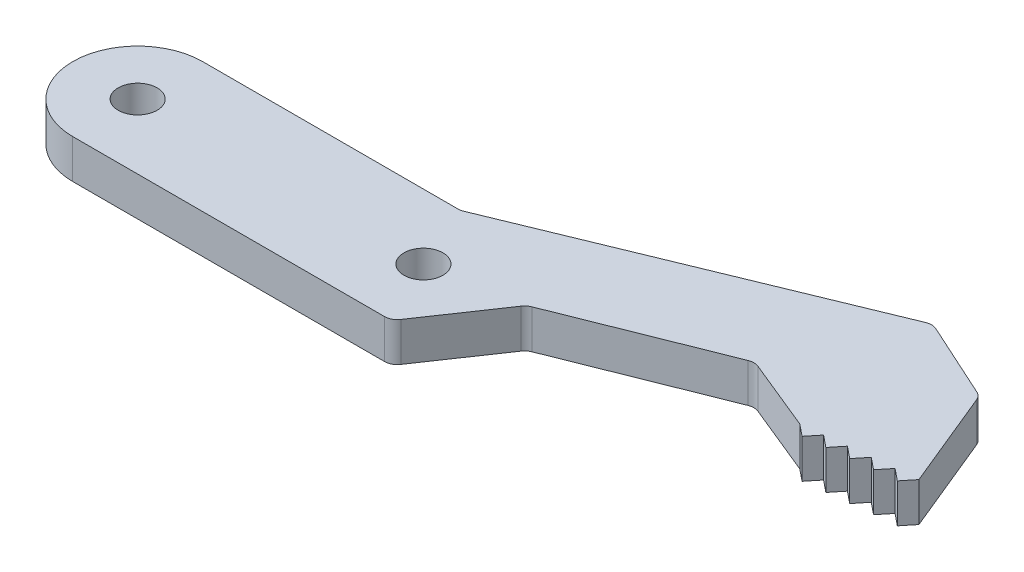
ISO-10303-21;
HEADER;
FILE_DESCRIPTION(('STEP AP214'),'2;1');
FILE_NAME('part.step','',(''),(''),'','','');
FILE_SCHEMA(('AUTOMOTIVE_DESIGN { 1 0 10303 214 1 1 1 1 }'));
ENDSEC;
DATA;
#1=APPLICATION_CONTEXT('core data for automotive mechanical design processes');
#2=APPLICATION_PROTOCOL_DEFINITION('international standard','automotive_design',2000,#1);
#3=PRODUCT_CONTEXT('',#1,'mechanical');
#4=PRODUCT('Part','Part','',(#3));
#5=PRODUCT_RELATED_PRODUCT_CATEGORY('part','',(#4));
#6=PRODUCT_DEFINITION_FORMATION('','',#4);
#7=PRODUCT_DEFINITION_CONTEXT('part definition',#1,'design');
#8=PRODUCT_DEFINITION('design','',#6,#7);
#9=PRODUCT_DEFINITION_SHAPE('','',#8);
#10=(LENGTH_UNIT() NAMED_UNIT(*) SI_UNIT(.MILLI.,.METRE.));
#11=(NAMED_UNIT(*) PLANE_ANGLE_UNIT() SI_UNIT($,.RADIAN.));
#12=(NAMED_UNIT(*) SI_UNIT($,.STERADIAN.) SOLID_ANGLE_UNIT());
#13=UNCERTAINTY_MEASURE_WITH_UNIT(LENGTH_MEASURE(1.E-05),#10,'distance_accuracy_value','');
#14=(GEOMETRIC_REPRESENTATION_CONTEXT(3) GLOBAL_UNCERTAINTY_ASSIGNED_CONTEXT((#13)) GLOBAL_UNIT_ASSIGNED_CONTEXT((#10,
#11,#12)) REPRESENTATION_CONTEXT('',''));
#15=CARTESIAN_POINT('',(0.,0.,0.));
#16=DIRECTION('',(0.,0.,1.));
#17=DIRECTION('',(1.,0.,0.));
#18=AXIS2_PLACEMENT_3D('',#15,#16,#17);
#19=CARTESIAN_POINT('',(29.3927079970185,3.,-0.393076672311641));
#20=DIRECTION('',(0.,-1.,0.));
#21=DIRECTION('',(0.,0.,-1.));
#22=AXIS2_PLACEMENT_3D('',#19,#20,#21);
#23=PLANE('',#22);
#24=CARTESIAN_POINT('',(29.3927079970185,3.,-0.393076672311641));
#25=DIRECTION('',(0.,-1.,0.));
#26=DIRECTION('',(0.,0.,-1.));
#27=AXIS2_PLACEMENT_3D('',#24,#25,#26);
#28=CIRCLE('',#27,1.);
#29=CARTESIAN_POINT('',(28.5649413257824,3.,-0.954149161381216));
#30=VERTEX_POINT('',#29);
#31=CARTESIAN_POINT('',(29.022312673,3.,-1.32195088551018));
#32=VERTEX_POINT('',#31);
#33=EDGE_CURVE('E280',#30,#32,#28,.T.);
#34=ORIENTED_EDGE('',*,*,#33,.T.);
#35=DIRECTION('',(0.92887421319854,0.,-0.370395324018532));
#36=VECTOR('',#35,1.);
#37=CARTESIAN_POINT('',(29.022312673,3.,-1.32195088551018));
#38=LINE('',#37,#36);
#39=CARTESIAN_POINT('',(40.9295532164884,3.,-6.07004934341117));
#40=VERTEX_POINT('',#39);
#41=EDGE_CURVE('E143',#32,#40,#38,.T.);
#42=ORIENTED_EDGE('',*,*,#41,.T.);
#43=CARTESIAN_POINT('',(41.2999485405069,3.,-5.14117513021263));
#44=DIRECTION('',(0.,-1.,0.));
#45=DIRECTION('',(0.,0.,-1.));
#46=AXIS2_PLACEMENT_3D('',#43,#44,#45);
#47=CIRCLE('',#46,1.);
#48=CARTESIAN_POINT('',(41.6787586893829,3.,-6.06664953348294));
#49=VERTEX_POINT('',#48);
#50=EDGE_CURVE('E346',#40,#49,#47,.T.);
#51=ORIENTED_EDGE('',*,*,#50,.T.);
#52=DIRECTION('',(0.925474403270305,0.,0.378810148876022));
#53=VECTOR('',#52,1.);
#54=CARTESIAN_POINT('',(41.6787586893829,3.,-6.06664953348294));
#55=LINE('',#54,#53);
#56=CARTESIAN_POINT('',(47.1445862437582,3.,-3.82940672883367));
#57=VERTEX_POINT('',#56);
#58=EDGE_CURVE('E365',#49,#57,#55,.T.);
#59=ORIENTED_EDGE('',*,*,#58,.T.);
#60=DIRECTION('',(0.777249081254573,0.,0.629193027368329));
#61=VECTOR('',#60,1.);
#62=CARTESIAN_POINT('',(47.1445862437582,3.,-3.82940672883367));
#63=LINE('',#62,#61);
#64=CARTESIAN_POINT('',(48.0617401596386,3.,-3.08695895653906));
#65=VERTEX_POINT('',#64);
#66=EDGE_CURVE('E362',#57,#65,#63,.T.);
#67=ORIENTED_EDGE('',*,*,#66,.T.);
#68=DIRECTION('',(0.629193027368274,0.,-0.777249081254617));
#69=VECTOR('',#68,1.);
#70=CARTESIAN_POINT('',(48.0617401596386,3.,-3.08695895653906));
#71=LINE('',#70,#69);
#72=CARTESIAN_POINT('',(48.8041879319331,3.,-4.0041128724195));
#73=VERTEX_POINT('',#72);
#74=EDGE_CURVE('E364',#65,#73,#71,.T.);
#75=ORIENTED_EDGE('',*,*,#74,.T.);
#76=DIRECTION('',(0.777249081254579,0.,0.62919302736832));
#77=VECTOR('',#76,1.);
#78=CARTESIAN_POINT('',(48.8041879319331,3.,-4.0041128724195));
#79=LINE('',#78,#77);
#80=CARTESIAN_POINT('',(49.7213418478136,3.,-3.26166510012488));
#81=VERTEX_POINT('',#80);
#82=EDGE_CURVE('E367',#73,#81,#79,.T.);
#83=ORIENTED_EDGE('',*,*,#82,.T.);
#84=DIRECTION('',(0.629193027368325,0.,-0.777249081254575));
#85=VECTOR('',#84,1.);
#86=CARTESIAN_POINT('',(49.7213418478136,3.,-3.26166510012488));
#87=LINE('',#86,#85);
#88=CARTESIAN_POINT('',(50.4637896201082,3.,-4.17881901600528));
#89=VERTEX_POINT('',#88);
#90=EDGE_CURVE('E373',#81,#89,#87,.T.);
#91=ORIENTED_EDGE('',*,*,#90,.T.);
#92=DIRECTION('',(0.777249081254577,0.,0.629193027368323));
#93=VECTOR('',#92,1.);
#94=CARTESIAN_POINT('',(50.4637896201082,3.,-4.17881901600528));
#95=LINE('',#94,#93);
#96=CARTESIAN_POINT('',(51.3809435359886,3.,-3.43637124371065));
#97=VERTEX_POINT('',#96);
#98=EDGE_CURVE('E375',#89,#97,#95,.T.);
#99=ORIENTED_EDGE('',*,*,#98,.T.);
#100=DIRECTION('',(0.629193027368326,0.,-0.777249081254575));
#101=VECTOR('',#100,1.);
#102=CARTESIAN_POINT('',(51.3809435359886,3.,-3.43637124371065));
#103=LINE('',#102,#101);
#104=CARTESIAN_POINT('',(52.1233913082832,3.,-4.35352515959105));
#105=VERTEX_POINT('',#104);
#106=EDGE_CURVE('E377',#97,#105,#103,.T.);
#107=ORIENTED_EDGE('',*,*,#106,.T.);
#108=DIRECTION('',(0.777249081254583,0.,0.629193027368317));
#109=VECTOR('',#108,1.);
#110=CARTESIAN_POINT('',(52.1233913082832,3.,-4.35352515959105));
#111=LINE('',#110,#109);
#112=CARTESIAN_POINT('',(53.0405452241636,3.,-3.61107738729644));
#113=VERTEX_POINT('',#112);
#114=EDGE_CURVE('E379',#105,#113,#111,.T.);
#115=ORIENTED_EDGE('',*,*,#114,.T.);
#116=DIRECTION('',(0.629193027368326,0.,-0.777249081254575));
#117=VECTOR('',#116,1.);
#118=CARTESIAN_POINT('',(53.0405452241636,3.,-3.61107738729644));
#119=LINE('',#118,#117);
#120=CARTESIAN_POINT('',(53.7829929964582,3.,-4.52823130317683));
#121=VERTEX_POINT('',#120);
#122=EDGE_CURVE('E381',#113,#121,#119,.T.);
#123=ORIENTED_EDGE('',*,*,#122,.T.);
#124=DIRECTION('',(0.777249081254587,0.,0.629193027368311));
#125=VECTOR('',#124,1.);
#126=CARTESIAN_POINT('',(53.7829929964582,3.,-4.52823130317683));
#127=LINE('',#126,#125);
#128=CARTESIAN_POINT('',(54.7001469123387,3.,-3.78578353088222));
#129=VERTEX_POINT('',#128);
#130=EDGE_CURVE('E383',#121,#129,#127,.T.);
#131=ORIENTED_EDGE('',*,*,#130,.T.);
#132=DIRECTION('',(0.629193027368273,0.,-0.777249081254618));
#133=VECTOR('',#132,1.);
#134=CARTESIAN_POINT('',(54.7001469123387,3.,-3.78578353088222));
#135=LINE('',#134,#133);
#136=CARTESIAN_POINT('',(55.4425946846332,3.,-4.70293744676266));
#137=VERTEX_POINT('',#136);
#138=EDGE_CURVE('E385',#129,#137,#135,.T.);
#139=ORIENTED_EDGE('',*,*,#138,.T.);
#140=DIRECTION('',(-0.380263412733204,0.,-0.92487822816655));
#141=VECTOR('',#140,1.);
#142=CARTESIAN_POINT('',(52.341745918113,3.,-12.2448345027485));
#143=LINE('',#142,#141);
#144=CARTESIAN_POINT('',(52.341745918113,3.,-12.2448345027485));
#145=VERTEX_POINT('',#144);
#146=EDGE_CURVE('E387',#137,#145,#143,.T.);
#147=ORIENTED_EDGE('',*,*,#146,.T.);
#148=CARTESIAN_POINT('',(51.4168676899464,3.,-11.8645710900153));
#149=DIRECTION('',(0.,1.,0.));
#150=DIRECTION('',(0.,0.,-1.));
#151=AXIS2_PLACEMENT_3D('',#148,#149,#150);
#152=CIRCLE('',#151,1.);
#153=CARTESIAN_POINT('',(51.8314021080849,3.,-12.7746047246566));
#154=VERTEX_POINT('',#153);
#155=EDGE_CURVE('E389',#145,#154,#152,.T.);
#156=ORIENTED_EDGE('',*,*,#155,.T.);
#157=DIRECTION('',(-0.910033634641374,0.,-0.414534418138482));
#158=VECTOR('',#157,1.);
#159=CARTESIAN_POINT('',(46.0241839243038,3.,-15.4198825684427));
#160=LINE('',#159,#158);
#161=CARTESIAN_POINT('',(46.0241839243038,3.,-15.4198825684427));
#162=VERTEX_POINT('',#161);
#163=EDGE_CURVE('E391',#154,#162,#160,.T.);
#164=ORIENTED_EDGE('',*,*,#163,.T.);
#165=CARTESIAN_POINT('',(45.6096495061653,3.,-14.5098489338013));
#166=DIRECTION('',(0.,1.,0.));
#167=DIRECTION('',(0.,0.,-1.));
#168=AXIS2_PLACEMENT_3D('',#165,#166,#167);
#169=CIRCLE('',#168,1.);
#170=CARTESIAN_POINT('',(45.2293860934321,3.,-15.4347271619678));
#171=VERTEX_POINT('',#170);
#172=EDGE_CURVE('E393',#162,#171,#169,.T.);
#173=ORIENTED_EDGE('',*,*,#172,.T.);
#174=DIRECTION('',(-0.924878228166549,0.,0.380263412733207));
#175=VECTOR('',#174,1.);
#176=CARTESIAN_POINT('',(20.0327114807882,3.,-5.07512177183345));
#177=LINE('',#176,#175);
#178=CARTESIAN_POINT('',(20.0327114807882,3.,-5.07512177183345));
#179=VERTEX_POINT('',#178);
#180=EDGE_CURVE('E395',#171,#179,#177,.T.);
#181=ORIENTED_EDGE('',*,*,#180,.T.);
#182=CARTESIAN_POINT('',(19.652448068055,3.,-6.));
#183=DIRECTION('',(0.,-1.,0.));
#184=DIRECTION('',(0.,0.,1.));
#185=AXIS2_PLACEMENT_3D('',#182,#183,#184);
#186=CIRCLE('',#185,1.);
#187=CARTESIAN_POINT('',(19.652448068055,3.,-5.));
#188=VERTEX_POINT('',#187);
#189=EDGE_CURVE('E397',#179,#188,#186,.T.);
#190=ORIENTED_EDGE('',*,*,#189,.T.);
#191=DIRECTION('',(-1.,0.,0.));
#192=VECTOR('',#191,1.);
#193=CARTESIAN_POINT('',(0.,3.,-5.));
#194=LINE('',#193,#192);
#195=CARTESIAN_POINT('',(0.,3.,-5.));
#196=VERTEX_POINT('',#195);
#197=EDGE_CURVE('E399',#188,#196,#194,.T.);
#198=ORIENTED_EDGE('',*,*,#197,.T.);
#199=CARTESIAN_POINT('',(0.,3.,0.));
#200=DIRECTION('',(0.,1.,0.));
#201=DIRECTION('',(0.,0.,1.));
#202=AXIS2_PLACEMENT_3D('',#199,#200,#201);
#203=CIRCLE('',#202,5.);
#204=CARTESIAN_POINT('',(0.,3.,5.));
#205=VERTEX_POINT('',#204);
#206=EDGE_CURVE('E213',#196,#205,#203,.T.);
#207=ORIENTED_EDGE('',*,*,#206,.T.);
#208=DIRECTION('',(1.,0.,0.));
#209=VECTOR('',#208,1.);
#210=CARTESIAN_POINT('',(0.,3.,5.));
#211=LINE('',#210,#209);
#212=CARTESIAN_POINT('',(23.9988758721515,3.,5.));
#213=VERTEX_POINT('',#212);
#214=EDGE_CURVE('E207',#205,#213,#211,.T.);
#215=ORIENTED_EDGE('',*,*,#214,.T.);
#216=CARTESIAN_POINT('',(23.9988758721515,3.,4.));
#217=DIRECTION('',(0.,1.,0.));
#218=DIRECTION('',(0.,0.,1.));
#219=AXIS2_PLACEMENT_3D('',#216,#217,#218);
#220=CIRCLE('',#219,1.);
#221=CARTESIAN_POINT('',(24.8266425433876,3.,4.56107248906957));
#222=VERTEX_POINT('',#221);
#223=EDGE_CURVE('E211',#213,#222,#220,.T.);
#224=ORIENTED_EDGE('',*,*,#223,.T.);
#225=DIRECTION('',(0.561072489069578,0.,-0.827766671236085));
#226=VECTOR('',#225,1.);
#227=CARTESIAN_POINT('',(24.8266425433876,3.,4.56107248906957));
#228=LINE('',#227,#226);
#229=EDGE_CURVE('E49',#222,#30,#228,.T.);
#230=ORIENTED_EDGE('',*,*,#229,.T.);
#231=EDGE_LOOP('',(#34,#42,#51,#59,#67,#75,#83,#91,#99,#107,#115,#123,#131,#139,#147,#156,#164,
#173,#181,#190,#198,#207,#215,#224,#230));
#232=FACE_BOUND('',#231,.T.);
#233=CARTESIAN_POINT('',(0.,3.,0.));
#234=DIRECTION('',(0.,1.,0.));
#235=DIRECTION('',(0.,0.,1.));
#236=AXIS2_PLACEMENT_3D('',#233,#234,#235);
#237=CIRCLE('',#236,1.5);
#238=CARTESIAN_POINT('',(0.,3.,1.5));
#239=VERTEX_POINT('',#238);
#240=EDGE_CURVE('E235',#239,#239,#237,.T.);
#241=ORIENTED_EDGE('',*,*,#240,.F.);
#242=EDGE_LOOP('',(#241));
#243=FACE_BOUND('',#242,.T.);
#244=CARTESIAN_POINT('',(22.,3.,0.));
#245=DIRECTION('',(0.,1.,0.));
#246=DIRECTION('',(0.,0.,1.));
#247=AXIS2_PLACEMENT_3D('',#244,#245,#246);
#248=CIRCLE('',#247,1.5);
#249=CARTESIAN_POINT('',(22.,3.,1.5));
#250=VERTEX_POINT('',#249);
#251=EDGE_CURVE('E440',#250,#250,#248,.T.);
#252=ORIENTED_EDGE('',*,*,#251,.F.);
#253=EDGE_LOOP('',(#252));
#254=FACE_BOUND('',#253,.T.);
#255=ADVANCED_FACE('F32',(#232,#243,#254),#23,.F.);
#256=CARTESIAN_POINT('',(29.3927079970185,0.,-0.393076672311641));
#257=DIRECTION('',(0.,-1.,0.));
#258=DIRECTION('',(0.,0.,-1.));
#259=AXIS2_PLACEMENT_3D('',#256,#257,#258);
#260=PLANE('',#259);
#261=CARTESIAN_POINT('',(0.,0.,0.));
#262=DIRECTION('',(0.,1.,0.));
#263=DIRECTION('',(0.,0.,1.));
#264=AXIS2_PLACEMENT_3D('',#261,#262,#263);
#265=CIRCLE('',#264,1.5);
#266=CARTESIAN_POINT('',(0.,0.,1.5));
#267=VERTEX_POINT('',#266);
#268=EDGE_CURVE('E445',#267,#267,#265,.T.);
#269=ORIENTED_EDGE('',*,*,#268,.T.);
#270=EDGE_LOOP('',(#269));
#271=FACE_BOUND('',#270,.T.);
#272=CARTESIAN_POINT('',(29.3927079970185,0.,-0.393076672311641));
#273=DIRECTION('',(0.,-1.,0.));
#274=DIRECTION('',(0.,0.,-1.));
#275=AXIS2_PLACEMENT_3D('',#272,#273,#274);
#276=CIRCLE('',#275,1.);
#277=CARTESIAN_POINT('',(28.5649413257824,0.,-0.954149161381216));
#278=VERTEX_POINT('',#277);
#279=CARTESIAN_POINT('',(29.022312673,0.,-1.32195088551018));
#280=VERTEX_POINT('',#279);
#281=EDGE_CURVE('E231',#278,#280,#276,.T.);
#282=ORIENTED_EDGE('',*,*,#281,.F.);
#283=DIRECTION('',(0.561072489069578,0.,-0.827766671236085));
#284=VECTOR('',#283,1.);
#285=CARTESIAN_POINT('',(24.8266425433876,0.,4.56107248906957));
#286=LINE('',#285,#284);
#287=CARTESIAN_POINT('',(24.8266425433876,0.,4.56107248906957));
#288=VERTEX_POINT('',#287);
#289=EDGE_CURVE('E135',#288,#278,#286,.T.);
#290=ORIENTED_EDGE('',*,*,#289,.F.);
#291=CARTESIAN_POINT('',(23.9988758721515,0.,4.));
#292=DIRECTION('',(0.,1.,0.));
#293=DIRECTION('',(0.,0.,1.));
#294=AXIS2_PLACEMENT_3D('',#291,#292,#293);
#295=CIRCLE('',#294,1.);
#296=CARTESIAN_POINT('',(23.9988758721515,0.,5.));
#297=VERTEX_POINT('',#296);
#298=EDGE_CURVE('E129',#297,#288,#295,.T.);
#299=ORIENTED_EDGE('',*,*,#298,.F.);
#300=DIRECTION('',(1.,0.,0.));
#301=VECTOR('',#300,1.);
#302=CARTESIAN_POINT('',(0.,0.,5.));
#303=LINE('',#302,#301);
#304=CARTESIAN_POINT('',(0.,0.,5.));
#305=VERTEX_POINT('',#304);
#306=EDGE_CURVE('E221',#305,#297,#303,.T.);
#307=ORIENTED_EDGE('',*,*,#306,.F.);
#308=CARTESIAN_POINT('',(0.,0.,0.));
#309=DIRECTION('',(0.,1.,0.));
#310=DIRECTION('',(0.,0.,1.));
#311=AXIS2_PLACEMENT_3D('',#308,#309,#310);
#312=CIRCLE('',#311,5.);
#313=CARTESIAN_POINT('',(0.,0.,-5.));
#314=VERTEX_POINT('',#313);
#315=EDGE_CURVE('E275',#314,#305,#312,.T.);
#316=ORIENTED_EDGE('',*,*,#315,.F.);
#317=DIRECTION('',(-1.,0.,0.));
#318=VECTOR('',#317,1.);
#319=CARTESIAN_POINT('',(0.,0.,-5.));
#320=LINE('',#319,#318);
#321=CARTESIAN_POINT('',(19.652448068055,0.,-5.));
#322=VERTEX_POINT('',#321);
#323=EDGE_CURVE('E273',#322,#314,#320,.T.);
#324=ORIENTED_EDGE('',*,*,#323,.F.);
#325=CARTESIAN_POINT('',(19.652448068055,0.,-6.));
#326=DIRECTION('',(0.,-1.,0.));
#327=DIRECTION('',(0.,0.,1.));
#328=AXIS2_PLACEMENT_3D('',#325,#326,#327);
#329=CIRCLE('',#328,1.);
#330=CARTESIAN_POINT('',(20.0327114807882,0.,-5.07512177183345));
#331=VERTEX_POINT('',#330);
#332=EDGE_CURVE('E271',#331,#322,#329,.T.);
#333=ORIENTED_EDGE('',*,*,#332,.F.);
#334=DIRECTION('',(-0.924878228166549,0.,0.380263412733207));
#335=VECTOR('',#334,1.);
#336=CARTESIAN_POINT('',(20.0327114807882,0.,-5.07512177183345));
#337=LINE('',#336,#335);
#338=CARTESIAN_POINT('',(45.2293860934321,0.,-15.4347271619678));
#339=VERTEX_POINT('',#338);
#340=EDGE_CURVE('E269',#339,#331,#337,.T.);
#341=ORIENTED_EDGE('',*,*,#340,.F.);
#342=CARTESIAN_POINT('',(45.6096495061653,0.,-14.5098489338013));
#343=DIRECTION('',(0.,1.,0.));
#344=DIRECTION('',(0.,0.,-1.));
#345=AXIS2_PLACEMENT_3D('',#342,#343,#344);
#346=CIRCLE('',#345,1.);
#347=CARTESIAN_POINT('',(46.0241839243038,0.,-15.4198825684427));
#348=VERTEX_POINT('',#347);
#349=EDGE_CURVE('E267',#348,#339,#346,.T.);
#350=ORIENTED_EDGE('',*,*,#349,.F.);
#351=DIRECTION('',(-0.910033634641374,0.,-0.414534418138482));
#352=VECTOR('',#351,1.);
#353=CARTESIAN_POINT('',(46.0241839243038,0.,-15.4198825684427));
#354=LINE('',#353,#352);
#355=CARTESIAN_POINT('',(51.8314021080849,0.,-12.7746047246566));
#356=VERTEX_POINT('',#355);
#357=EDGE_CURVE('E265',#356,#348,#354,.T.);
#358=ORIENTED_EDGE('',*,*,#357,.F.);
#359=CARTESIAN_POINT('',(51.4168676899464,0.,-11.8645710900153));
#360=DIRECTION('',(0.,1.,0.));
#361=DIRECTION('',(0.,0.,-1.));
#362=AXIS2_PLACEMENT_3D('',#359,#360,#361);
#363=CIRCLE('',#362,1.);
#364=CARTESIAN_POINT('',(52.341745918113,0.,-12.2448345027485));
#365=VERTEX_POINT('',#364);
#366=EDGE_CURVE('E263',#365,#356,#363,.T.);
#367=ORIENTED_EDGE('',*,*,#366,.F.);
#368=DIRECTION('',(-0.380263412733204,0.,-0.92487822816655));
#369=VECTOR('',#368,1.);
#370=CARTESIAN_POINT('',(52.341745918113,0.,-12.2448345027485));
#371=LINE('',#370,#369);
#372=CARTESIAN_POINT('',(55.4425946846332,0.,-4.70293744676266));
#373=VERTEX_POINT('',#372);
#374=EDGE_CURVE('E261',#373,#365,#371,.T.);
#375=ORIENTED_EDGE('',*,*,#374,.F.);
#376=DIRECTION('',(0.629193027368273,0.,-0.777249081254618));
#377=VECTOR('',#376,1.);
#378=CARTESIAN_POINT('',(54.7001469123387,0.,-3.78578353088222));
#379=LINE('',#378,#377);
#380=CARTESIAN_POINT('',(54.7001469123387,0.,-3.78578353088222));
#381=VERTEX_POINT('',#380);
#382=EDGE_CURVE('E259',#381,#373,#379,.T.);
#383=ORIENTED_EDGE('',*,*,#382,.F.);
#384=DIRECTION('',(0.777249081254587,0.,0.629193027368311));
#385=VECTOR('',#384,1.);
#386=CARTESIAN_POINT('',(53.7829929964582,0.,-4.52823130317683));
#387=LINE('',#386,#385);
#388=CARTESIAN_POINT('',(53.7829929964582,0.,-4.52823130317683));
#389=VERTEX_POINT('',#388);
#390=EDGE_CURVE('E257',#389,#381,#387,.T.);
#391=ORIENTED_EDGE('',*,*,#390,.F.);
#392=DIRECTION('',(0.629193027368326,0.,-0.777249081254575));
#393=VECTOR('',#392,1.);
#394=CARTESIAN_POINT('',(53.0405452241636,0.,-3.61107738729644));
#395=LINE('',#394,#393);
#396=CARTESIAN_POINT('',(53.0405452241636,0.,-3.61107738729644));
#397=VERTEX_POINT('',#396);
#398=EDGE_CURVE('E255',#397,#389,#395,.T.);
#399=ORIENTED_EDGE('',*,*,#398,.F.);
#400=DIRECTION('',(0.777249081254583,0.,0.629193027368317));
#401=VECTOR('',#400,1.);
#402=CARTESIAN_POINT('',(52.1233913082832,0.,-4.35352515959105));
#403=LINE('',#402,#401);
#404=CARTESIAN_POINT('',(52.1233913082832,0.,-4.35352515959105));
#405=VERTEX_POINT('',#404);
#406=EDGE_CURVE('E253',#405,#397,#403,.T.);
#407=ORIENTED_EDGE('',*,*,#406,.F.);
#408=DIRECTION('',(0.629193027368326,0.,-0.777249081254575));
#409=VECTOR('',#408,1.);
#410=CARTESIAN_POINT('',(51.3809435359886,0.,-3.43637124371065));
#411=LINE('',#410,#409);
#412=CARTESIAN_POINT('',(51.3809435359886,0.,-3.43637124371065));
#413=VERTEX_POINT('',#412);
#414=EDGE_CURVE('E251',#413,#405,#411,.T.);
#415=ORIENTED_EDGE('',*,*,#414,.F.);
#416=DIRECTION('',(0.777249081254577,0.,0.629193027368323));
#417=VECTOR('',#416,1.);
#418=CARTESIAN_POINT('',(50.4637896201082,0.,-4.17881901600528));
#419=LINE('',#418,#417);
#420=CARTESIAN_POINT('',(50.4637896201082,0.,-4.17881901600528));
#421=VERTEX_POINT('',#420);
#422=EDGE_CURVE('E249',#421,#413,#419,.T.);
#423=ORIENTED_EDGE('',*,*,#422,.F.);
#424=DIRECTION('',(0.629193027368325,0.,-0.777249081254575));
#425=VECTOR('',#424,1.);
#426=CARTESIAN_POINT('',(49.7213418478136,0.,-3.26166510012488));
#427=LINE('',#426,#425);
#428=CARTESIAN_POINT('',(49.7213418478136,0.,-3.26166510012488));
#429=VERTEX_POINT('',#428);
#430=EDGE_CURVE('E247',#429,#421,#427,.T.);
#431=ORIENTED_EDGE('',*,*,#430,.F.);
#432=DIRECTION('',(0.777249081254579,0.,0.62919302736832));
#433=VECTOR('',#432,1.);
#434=CARTESIAN_POINT('',(48.8041879319331,0.,-4.0041128724195));
#435=LINE('',#434,#433);
#436=CARTESIAN_POINT('',(48.8041879319331,0.,-4.0041128724195));
#437=VERTEX_POINT('',#436);
#438=EDGE_CURVE('E245',#437,#429,#435,.T.);
#439=ORIENTED_EDGE('',*,*,#438,.F.);
#440=DIRECTION('',(0.629193027368274,0.,-0.777249081254617));
#441=VECTOR('',#440,1.);
#442=CARTESIAN_POINT('',(48.0617401596386,0.,-3.08695895653906));
#443=LINE('',#442,#441);
#444=CARTESIAN_POINT('',(48.0617401596386,0.,-3.08695895653906));
#445=VERTEX_POINT('',#444);
#446=EDGE_CURVE('E243',#445,#437,#443,.T.);
#447=ORIENTED_EDGE('',*,*,#446,.F.);
#448=DIRECTION('',(0.777249081254573,0.,0.629193027368329));
#449=VECTOR('',#448,1.);
#450=CARTESIAN_POINT('',(47.1445862437582,0.,-3.82940672883367));
#451=LINE('',#450,#449);
#452=CARTESIAN_POINT('',(47.1445862437582,0.,-3.82940672883367));
#453=VERTEX_POINT('',#452);
#454=EDGE_CURVE('E241',#453,#445,#451,.T.);
#455=ORIENTED_EDGE('',*,*,#454,.F.);
#456=DIRECTION('',(0.925474403270305,0.,0.378810148876022));
#457=VECTOR('',#456,1.);
#458=CARTESIAN_POINT('',(41.6787586893829,0.,-6.06664953348294));
#459=LINE('',#458,#457);
#460=CARTESIAN_POINT('',(41.6787586893829,0.,-6.06664953348294));
#461=VERTEX_POINT('',#460);
#462=EDGE_CURVE('E239',#461,#453,#459,.T.);
#463=ORIENTED_EDGE('',*,*,#462,.F.);
#464=CARTESIAN_POINT('',(41.2999485405069,0.,-5.14117513021263));
#465=DIRECTION('',(0.,-1.,0.));
#466=DIRECTION('',(0.,0.,-1.));
#467=AXIS2_PLACEMENT_3D('',#464,#465,#466);
#468=CIRCLE('',#467,1.);
#469=CARTESIAN_POINT('',(40.9295532164884,0.,-6.07004934341117));
#470=VERTEX_POINT('',#469);
#471=EDGE_CURVE('E237',#470,#461,#468,.T.);
#472=ORIENTED_EDGE('',*,*,#471,.F.);
#473=DIRECTION('',(0.92887421319854,0.,-0.370395324018532));
#474=VECTOR('',#473,1.);
#475=CARTESIAN_POINT('',(29.022312673,0.,-1.32195088551018));
#476=LINE('',#475,#474);
#477=EDGE_CURVE('E234',#280,#470,#476,.T.);
#478=ORIENTED_EDGE('',*,*,#477,.F.);
#479=EDGE_LOOP('',(#282,#290,#299,#307,#316,#324,#333,#341,#350,#358,#367,#375,#383,#391,#399,
#407,#415,#423,#431,#439,#447,#455,#463,#472,#478));
#480=FACE_BOUND('',#479,.T.);
#481=CARTESIAN_POINT('',(22.,0.,0.));
#482=DIRECTION('',(0.,1.,0.));
#483=DIRECTION('',(0.,0.,1.));
#484=AXIS2_PLACEMENT_3D('',#481,#482,#483);
#485=CIRCLE('',#484,1.5);
#486=CARTESIAN_POINT('',(22.,0.,1.5));
#487=VERTEX_POINT('',#486);
#488=EDGE_CURVE('E443',#487,#487,#485,.T.);
#489=ORIENTED_EDGE('',*,*,#488,.T.);
#490=EDGE_LOOP('',(#489));
#491=FACE_BOUND('',#490,.T.);
#492=ADVANCED_FACE('F350',(#271,#480,#491),#260,.T.);
#493=CARTESIAN_POINT('',(29.3927079970185,3.,-0.393076672311641));
#494=DIRECTION('',(0.,-1.,0.));
#495=DIRECTION('',(0.,0.,-1.));
#496=AXIS2_PLACEMENT_3D('',#493,#494,#495);
#497=CYLINDRICAL_SURFACE('',#496,1.);
#498=ORIENTED_EDGE('',*,*,#281,.T.);
#499=DIRECTION('',(0.,-1.,0.));
#500=VECTOR('',#499,1.);
#501=CARTESIAN_POINT('',(29.022312673,3.,-1.32195088551018));
#502=LINE('',#501,#500);
#503=EDGE_CURVE('E11',#32,#280,#502,.T.);
#504=ORIENTED_EDGE('',*,*,#503,.F.);
#505=ORIENTED_EDGE('',*,*,#33,.F.);
#506=DIRECTION('',(0.,-1.,0.));
#507=VECTOR('',#506,1.);
#508=CARTESIAN_POINT('',(28.5649413257824,3.,-0.954149161381216));
#509=LINE('',#508,#507);
#510=EDGE_CURVE('E227',#30,#278,#509,.T.);
#511=ORIENTED_EDGE('',*,*,#510,.T.);
#512=EDGE_LOOP('',(#498,#504,#505,#511));
#513=FACE_BOUND('',#512,.T.);
#514=ADVANCED_FACE('F34',(#513),#497,.F.);
#515=CARTESIAN_POINT('',(29.022312673,3.,-1.32195088551018));
#516=DIRECTION('',(-0.370395324018532,0.,-0.92887421319854));
#517=DIRECTION('',(-0.92887421319854,0.,0.370395324018532));
#518=AXIS2_PLACEMENT_3D('',#515,#516,#517);
#519=PLANE('',#518);
#520=ORIENTED_EDGE('',*,*,#477,.T.);
#521=DIRECTION('',(0.,-1.,0.));
#522=VECTOR('',#521,1.);
#523=CARTESIAN_POINT('',(40.9295532164884,3.,-6.07004934341117));
#524=LINE('',#523,#522);
#525=EDGE_CURVE('E41',#40,#470,#524,.T.);
#526=ORIENTED_EDGE('',*,*,#525,.F.);
#527=ORIENTED_EDGE('',*,*,#41,.F.);
#528=ORIENTED_EDGE('',*,*,#503,.T.);
#529=EDGE_LOOP('',(#520,#526,#527,#528));
#530=FACE_BOUND('',#529,.T.);
#531=ADVANCED_FACE('F670',(#530),#519,.F.);
#532=CARTESIAN_POINT('',(41.2999485405069,3.,-5.14117513021263));
#533=DIRECTION('',(0.,-1.,0.));
#534=DIRECTION('',(0.,0.,-1.));
#535=AXIS2_PLACEMENT_3D('',#532,#533,#534);
#536=CYLINDRICAL_SURFACE('',#535,1.);
#537=ORIENTED_EDGE('',*,*,#471,.T.);
#538=DIRECTION('',(0.,-1.,0.));
#539=VECTOR('',#538,1.);
#540=CARTESIAN_POINT('',(41.6787586893829,3.,-6.06664953348294));
#541=LINE('',#540,#539);
#542=EDGE_CURVE('E338',#49,#461,#541,.T.);
#543=ORIENTED_EDGE('',*,*,#542,.F.);
#544=ORIENTED_EDGE('',*,*,#50,.F.);
#545=ORIENTED_EDGE('',*,*,#525,.T.);
#546=EDGE_LOOP('',(#537,#543,#544,#545));
#547=FACE_BOUND('',#546,.T.);
#548=ADVANCED_FACE('F344',(#547),#536,.F.);
#549=CARTESIAN_POINT('',(41.6787586893829,3.,-6.06664953348294));
#550=DIRECTION('',(0.378810148876022,0.,-0.925474403270305));
#551=DIRECTION('',(-0.925474403270305,0.,-0.378810148876022));
#552=AXIS2_PLACEMENT_3D('',#549,#550,#551);
#553=PLANE('',#552);
#554=ORIENTED_EDGE('',*,*,#462,.T.);
#555=DIRECTION('',(0.,-1.,0.));
#556=VECTOR('',#555,1.);
#557=CARTESIAN_POINT('',(47.1445862437582,3.,-3.82940672883367));
#558=LINE('',#557,#556);
#559=EDGE_CURVE('E335',#57,#453,#558,.T.);
#560=ORIENTED_EDGE('',*,*,#559,.F.);
#561=ORIENTED_EDGE('',*,*,#58,.F.);
#562=ORIENTED_EDGE('',*,*,#542,.T.);
#563=EDGE_LOOP('',(#554,#560,#561,#562));
#564=FACE_BOUND('',#563,.T.);
#565=ADVANCED_FACE('F356',(#564),#553,.F.);
#566=CARTESIAN_POINT('',(47.1445862437582,3.,-3.82940672883367));
#567=DIRECTION('',(0.629193027368329,0.,-0.777249081254573));
#568=DIRECTION('',(-0.777249081254573,0.,-0.629193027368329));
#569=AXIS2_PLACEMENT_3D('',#566,#567,#568);
#570=PLANE('',#569);
#571=ORIENTED_EDGE('',*,*,#454,.T.);
#572=DIRECTION('',(0.,-1.,0.));
#573=VECTOR('',#572,1.);
#574=CARTESIAN_POINT('',(48.0617401596386,3.,-3.08695895653906));
#575=LINE('',#574,#573);
#576=EDGE_CURVE('E332',#65,#445,#575,.T.);
#577=ORIENTED_EDGE('',*,*,#576,.F.);
#578=ORIENTED_EDGE('',*,*,#66,.F.);
#579=ORIENTED_EDGE('',*,*,#559,.T.);
#580=EDGE_LOOP('',(#571,#577,#578,#579));
#581=FACE_BOUND('',#580,.T.);
#582=ADVANCED_FACE('F360',(#581),#570,.F.);
#583=CARTESIAN_POINT('',(48.0617401596386,3.,-3.08695895653906));
#584=DIRECTION('',(-0.777249081254617,0.,-0.629193027368274));
#585=DIRECTION('',(-0.629193027368274,0.,0.777249081254617));
#586=AXIS2_PLACEMENT_3D('',#583,#584,#585);
#587=PLANE('',#586);
#588=ORIENTED_EDGE('',*,*,#446,.T.);
#589=DIRECTION('',(0.,-1.,0.));
#590=VECTOR('',#589,1.);
#591=CARTESIAN_POINT('',(48.8041879319331,3.,-4.0041128724195));
#592=LINE('',#591,#590);
#593=EDGE_CURVE('E329',#73,#437,#592,.T.);
#594=ORIENTED_EDGE('',*,*,#593,.F.);
#595=ORIENTED_EDGE('',*,*,#74,.F.);
#596=ORIENTED_EDGE('',*,*,#576,.T.);
#597=EDGE_LOOP('',(#588,#594,#595,#596));
#598=FACE_BOUND('',#597,.T.);
#599=ADVANCED_FACE('F635',(#598),#587,.F.);
#600=CARTESIAN_POINT('',(48.8041879319331,3.,-4.0041128724195));
#601=DIRECTION('',(0.62919302736832,0.,-0.77724908125458));
#602=DIRECTION('',(-0.77724908125458,0.,-0.62919302736832));
#603=AXIS2_PLACEMENT_3D('',#600,#601,#602);
#604=PLANE('',#603);
#605=ORIENTED_EDGE('',*,*,#438,.T.);
#606=DIRECTION('',(0.,-1.,0.));
#607=VECTOR('',#606,1.);
#608=CARTESIAN_POINT('',(49.7213418478136,3.,-3.26166510012488));
#609=LINE('',#608,#607);
#610=EDGE_CURVE('E326',#81,#429,#609,.T.);
#611=ORIENTED_EDGE('',*,*,#610,.F.);
#612=ORIENTED_EDGE('',*,*,#82,.F.);
#613=ORIENTED_EDGE('',*,*,#593,.T.);
#614=EDGE_LOOP('',(#605,#611,#612,#613));
#615=FACE_BOUND('',#614,.T.);
#616=ADVANCED_FACE('F625',(#615),#604,.F.);
#617=CARTESIAN_POINT('',(49.7213418478136,3.,-3.26166510012488));
#618=DIRECTION('',(-0.777249081254575,0.,-0.629193027368325));
#619=DIRECTION('',(-0.629193027368325,0.,0.777249081254576));
#620=AXIS2_PLACEMENT_3D('',#617,#618,#619);
#621=PLANE('',#620);
#622=ORIENTED_EDGE('',*,*,#430,.T.);
#623=DIRECTION('',(0.,-1.,0.));
#624=VECTOR('',#623,1.);
#625=CARTESIAN_POINT('',(50.4637896201082,3.,-4.17881901600528));
#626=LINE('',#625,#624);
#627=EDGE_CURVE('E323',#89,#421,#626,.T.);
#628=ORIENTED_EDGE('',*,*,#627,.F.);
#629=ORIENTED_EDGE('',*,*,#90,.F.);
#630=ORIENTED_EDGE('',*,*,#610,.T.);
#631=EDGE_LOOP('',(#622,#628,#629,#630));
#632=FACE_BOUND('',#631,.T.);
#633=ADVANCED_FACE('F615',(#632),#621,.F.);
#634=CARTESIAN_POINT('',(50.4637896201082,3.,-4.17881901600528));
#635=DIRECTION('',(0.629193027368323,0.,-0.777249081254577));
#636=DIRECTION('',(-0.777249081254577,0.,-0.629193027368323));
#637=AXIS2_PLACEMENT_3D('',#634,#635,#636);
#638=PLANE('',#637);
#639=ORIENTED_EDGE('',*,*,#422,.T.);
#640=DIRECTION('',(0.,-1.,0.));
#641=VECTOR('',#640,1.);
#642=CARTESIAN_POINT('',(51.3809435359886,3.,-3.43637124371065));
#643=LINE('',#642,#641);
#644=EDGE_CURVE('E320',#97,#413,#643,.T.);
#645=ORIENTED_EDGE('',*,*,#644,.F.);
#646=ORIENTED_EDGE('',*,*,#98,.F.);
#647=ORIENTED_EDGE('',*,*,#627,.T.);
#648=EDGE_LOOP('',(#639,#645,#646,#647));
#649=FACE_BOUND('',#648,.T.);
#650=ADVANCED_FACE('F605',(#649),#638,.F.);
#651=CARTESIAN_POINT('',(51.3809435359886,3.,-3.43637124371065));
#652=DIRECTION('',(-0.777249081254575,0.,-0.629193027368326));
#653=DIRECTION('',(-0.629193027368326,0.,0.777249081254575));
#654=AXIS2_PLACEMENT_3D('',#651,#652,#653);
#655=PLANE('',#654);
#656=ORIENTED_EDGE('',*,*,#414,.T.);
#657=DIRECTION('',(0.,-1.,0.));
#658=VECTOR('',#657,1.);
#659=CARTESIAN_POINT('',(52.1233913082832,3.,-4.35352515959105));
#660=LINE('',#659,#658);
#661=EDGE_CURVE('E317',#105,#405,#660,.T.);
#662=ORIENTED_EDGE('',*,*,#661,.F.);
#663=ORIENTED_EDGE('',*,*,#106,.F.);
#664=ORIENTED_EDGE('',*,*,#644,.T.);
#665=EDGE_LOOP('',(#656,#662,#663,#664));
#666=FACE_BOUND('',#665,.T.);
#667=ADVANCED_FACE('F595',(#666),#655,.F.);
#668=CARTESIAN_POINT('',(52.1233913082832,3.,-4.35352515959105));
#669=DIRECTION('',(0.629193027368317,0.,-0.777249081254583));
#670=DIRECTION('',(-0.777249081254583,0.,-0.629193027368317));
#671=AXIS2_PLACEMENT_3D('',#668,#669,#670);
#672=PLANE('',#671);
#673=ORIENTED_EDGE('',*,*,#406,.T.);
#674=DIRECTION('',(0.,-1.,0.));
#675=VECTOR('',#674,1.);
#676=CARTESIAN_POINT('',(53.0405452241636,3.,-3.61107738729644));
#677=LINE('',#676,#675);
#678=EDGE_CURVE('E314',#113,#397,#677,.T.);
#679=ORIENTED_EDGE('',*,*,#678,.F.);
#680=ORIENTED_EDGE('',*,*,#114,.F.);
#681=ORIENTED_EDGE('',*,*,#661,.T.);
#682=EDGE_LOOP('',(#673,#679,#680,#681));
#683=FACE_BOUND('',#682,.T.);
#684=ADVANCED_FACE('F585',(#683),#672,.F.);
#685=CARTESIAN_POINT('',(53.0405452241636,3.,-3.61107738729644));
#686=DIRECTION('',(-0.777249081254575,0.,-0.629193027368326));
#687=DIRECTION('',(-0.629193027368326,0.,0.777249081254575));
#688=AXIS2_PLACEMENT_3D('',#685,#686,#687);
#689=PLANE('',#688);
#690=ORIENTED_EDGE('',*,*,#398,.T.);
#691=DIRECTION('',(0.,-1.,0.));
#692=VECTOR('',#691,1.);
#693=CARTESIAN_POINT('',(53.7829929964582,3.,-4.52823130317683));
#694=LINE('',#693,#692);
#695=EDGE_CURVE('E311',#121,#389,#694,.T.);
#696=ORIENTED_EDGE('',*,*,#695,.F.);
#697=ORIENTED_EDGE('',*,*,#122,.F.);
#698=ORIENTED_EDGE('',*,*,#678,.T.);
#699=EDGE_LOOP('',(#690,#696,#697,#698));
#700=FACE_BOUND('',#699,.T.);
#701=ADVANCED_FACE('F575',(#700),#689,.F.);
#702=CARTESIAN_POINT('',(53.7829929964582,3.,-4.52823130317683));
#703=DIRECTION('',(0.629193027368311,0.,-0.777249081254587));
#704=DIRECTION('',(-0.777249081254587,0.,-0.629193027368311));
#705=AXIS2_PLACEMENT_3D('',#702,#703,#704);
#706=PLANE('',#705);
#707=ORIENTED_EDGE('',*,*,#390,.T.);
#708=DIRECTION('',(0.,-1.,0.));
#709=VECTOR('',#708,1.);
#710=CARTESIAN_POINT('',(54.7001469123387,3.,-3.78578353088222));
#711=LINE('',#710,#709);
#712=EDGE_CURVE('E308',#129,#381,#711,.T.);
#713=ORIENTED_EDGE('',*,*,#712,.F.);
#714=ORIENTED_EDGE('',*,*,#130,.F.);
#715=ORIENTED_EDGE('',*,*,#695,.T.);
#716=EDGE_LOOP('',(#707,#713,#714,#715));
#717=FACE_BOUND('',#716,.T.);
#718=ADVANCED_FACE('F565',(#717),#706,.F.);
#719=CARTESIAN_POINT('',(54.7001469123387,3.,-3.78578353088222));
#720=DIRECTION('',(-0.777249081254618,0.,-0.629193027368273));
#721=DIRECTION('',(-0.629193027368273,0.,0.777249081254618));
#722=AXIS2_PLACEMENT_3D('',#719,#720,#721);
#723=PLANE('',#722);
#724=ORIENTED_EDGE('',*,*,#382,.T.);
#725=DIRECTION('',(0.,-1.,0.));
#726=VECTOR('',#725,1.);
#727=CARTESIAN_POINT('',(55.4425946846332,3.,-4.70293744676266));
#728=LINE('',#727,#726);
#729=EDGE_CURVE('E305',#137,#373,#728,.T.);
#730=ORIENTED_EDGE('',*,*,#729,.F.);
#731=ORIENTED_EDGE('',*,*,#138,.F.);
#732=ORIENTED_EDGE('',*,*,#712,.T.);
#733=EDGE_LOOP('',(#724,#730,#731,#732));
#734=FACE_BOUND('',#733,.T.);
#735=ADVANCED_FACE('F555',(#734),#723,.F.);
#736=CARTESIAN_POINT('',(52.341745918113,3.,-12.2448345027485));
#737=DIRECTION('',(-0.92487822816655,0.,0.380263412733204));
#738=DIRECTION('',(0.380263412733204,0.,0.92487822816655));
#739=AXIS2_PLACEMENT_3D('',#736,#737,#738);
#740=PLANE('',#739);
#741=ORIENTED_EDGE('',*,*,#374,.T.);
#742=DIRECTION('',(0.,-1.,0.));
#743=VECTOR('',#742,1.);
#744=CARTESIAN_POINT('',(52.341745918113,3.,-12.2448345027485));
#745=LINE('',#744,#743);
#746=EDGE_CURVE('E302',#145,#365,#745,.T.);
#747=ORIENTED_EDGE('',*,*,#746,.F.);
#748=ORIENTED_EDGE('',*,*,#146,.F.);
#749=ORIENTED_EDGE('',*,*,#729,.T.);
#750=EDGE_LOOP('',(#741,#747,#748,#749));
#751=FACE_BOUND('',#750,.T.);
#752=ADVANCED_FACE('F545',(#751),#740,.F.);
#753=CARTESIAN_POINT('',(51.4168676899464,3.,-11.8645710900153));
#754=DIRECTION('',(0.,-1.,0.));
#755=DIRECTION('',(0.,0.,-1.));
#756=AXIS2_PLACEMENT_3D('',#753,#754,#755);
#757=CYLINDRICAL_SURFACE('',#756,1.);
#758=ORIENTED_EDGE('',*,*,#366,.T.);
#759=DIRECTION('',(0.,-1.,0.));
#760=VECTOR('',#759,1.);
#761=CARTESIAN_POINT('',(51.8314021080849,3.,-12.7746047246566));
#762=LINE('',#761,#760);
#763=EDGE_CURVE('E299',#154,#356,#762,.T.);
#764=ORIENTED_EDGE('',*,*,#763,.F.);
#765=ORIENTED_EDGE('',*,*,#155,.F.);
#766=ORIENTED_EDGE('',*,*,#746,.T.);
#767=EDGE_LOOP('',(#758,#764,#765,#766));
#768=FACE_BOUND('',#767,.T.);
#769=ADVANCED_FACE('F535',(#768),#757,.T.);
#770=CARTESIAN_POINT('',(46.0241839243038,3.,-15.4198825684427));
#771=DIRECTION('',(-0.414534418138482,0.,0.910033634641374));
#772=DIRECTION('',(0.910033634641374,0.,0.414534418138482));
#773=AXIS2_PLACEMENT_3D('',#770,#771,#772);
#774=PLANE('',#773);
#775=ORIENTED_EDGE('',*,*,#357,.T.);
#776=DIRECTION('',(0.,-1.,0.));
#777=VECTOR('',#776,1.);
#778=CARTESIAN_POINT('',(46.0241839243038,3.,-15.4198825684427));
#779=LINE('',#778,#777);
#780=EDGE_CURVE('E296',#162,#348,#779,.T.);
#781=ORIENTED_EDGE('',*,*,#780,.F.);
#782=ORIENTED_EDGE('',*,*,#163,.F.);
#783=ORIENTED_EDGE('',*,*,#763,.T.);
#784=EDGE_LOOP('',(#775,#781,#782,#783));
#785=FACE_BOUND('',#784,.T.);
#786=ADVANCED_FACE('F525',(#785),#774,.F.);
#787=CARTESIAN_POINT('',(45.6096495061653,3.,-14.5098489338013));
#788=DIRECTION('',(0.,-1.,0.));
#789=DIRECTION('',(0.,0.,-1.));
#790=AXIS2_PLACEMENT_3D('',#787,#788,#789);
#791=CYLINDRICAL_SURFACE('',#790,1.);
#792=ORIENTED_EDGE('',*,*,#349,.T.);
#793=DIRECTION('',(0.,-1.,0.));
#794=VECTOR('',#793,1.);
#795=CARTESIAN_POINT('',(45.2293860934321,3.,-15.4347271619678));
#796=LINE('',#795,#794);
#797=EDGE_CURVE('E293',#171,#339,#796,.T.);
#798=ORIENTED_EDGE('',*,*,#797,.F.);
#799=ORIENTED_EDGE('',*,*,#172,.F.);
#800=ORIENTED_EDGE('',*,*,#780,.T.);
#801=EDGE_LOOP('',(#792,#798,#799,#800));
#802=FACE_BOUND('',#801,.T.);
#803=ADVANCED_FACE('F515',(#802),#791,.T.);
#804=CARTESIAN_POINT('',(20.0327114807882,3.,-5.07512177183345));
#805=DIRECTION('',(0.380263412733207,0.,0.924878228166549));
#806=DIRECTION('',(0.924878228166549,0.,-0.380263412733207));
#807=AXIS2_PLACEMENT_3D('',#804,#805,#806);
#808=PLANE('',#807);
#809=ORIENTED_EDGE('',*,*,#340,.T.);
#810=DIRECTION('',(0.,-1.,0.));
#811=VECTOR('',#810,1.);
#812=CARTESIAN_POINT('',(20.0327114807882,3.,-5.07512177183345));
#813=LINE('',#812,#811);
#814=EDGE_CURVE('E290',#179,#331,#813,.T.);
#815=ORIENTED_EDGE('',*,*,#814,.F.);
#816=ORIENTED_EDGE('',*,*,#180,.F.);
#817=ORIENTED_EDGE('',*,*,#797,.T.);
#818=EDGE_LOOP('',(#809,#815,#816,#817));
#819=FACE_BOUND('',#818,.T.);
#820=ADVANCED_FACE('F505',(#819),#808,.F.);
#821=CARTESIAN_POINT('',(19.652448068055,3.,-6.));
#822=DIRECTION('',(0.,-1.,0.));
#823=DIRECTION('',(0.,0.,-1.));
#824=AXIS2_PLACEMENT_3D('',#821,#822,#823);
#825=CYLINDRICAL_SURFACE('',#824,1.);
#826=ORIENTED_EDGE('',*,*,#332,.T.);
#827=DIRECTION('',(0.,-1.,0.));
#828=VECTOR('',#827,1.);
#829=CARTESIAN_POINT('',(19.652448068055,3.,-5.));
#830=LINE('',#829,#828);
#831=EDGE_CURVE('E287',#188,#322,#830,.T.);
#832=ORIENTED_EDGE('',*,*,#831,.F.);
#833=ORIENTED_EDGE('',*,*,#189,.F.);
#834=ORIENTED_EDGE('',*,*,#814,.T.);
#835=EDGE_LOOP('',(#826,#832,#833,#834));
#836=FACE_BOUND('',#835,.T.);
#837=ADVANCED_FACE('F496',(#836),#825,.F.);
#838=CARTESIAN_POINT('',(0.,3.,-5.));
#839=DIRECTION('',(0.,0.,1.));
#840=DIRECTION('',(1.,0.,0.));
#841=AXIS2_PLACEMENT_3D('',#838,#839,#840);
#842=PLANE('',#841);
#843=ORIENTED_EDGE('',*,*,#323,.T.);
#844=DIRECTION('',(0.,-1.,0.));
#845=VECTOR('',#844,1.);
#846=CARTESIAN_POINT('',(0.,3.,-5.));
#847=LINE('',#846,#845);
#848=EDGE_CURVE('E284',#196,#314,#847,.T.);
#849=ORIENTED_EDGE('',*,*,#848,.F.);
#850=ORIENTED_EDGE('',*,*,#197,.F.);
#851=ORIENTED_EDGE('',*,*,#831,.T.);
#852=EDGE_LOOP('',(#843,#849,#850,#851));
#853=FACE_BOUND('',#852,.T.);
#854=ADVANCED_FACE('F405',(#853),#842,.F.);
#855=CARTESIAN_POINT('',(0.,3.,0.));
#856=DIRECTION('',(0.,-1.,0.));
#857=DIRECTION('',(0.,0.,-1.));
#858=AXIS2_PLACEMENT_3D('',#855,#856,#857);
#859=CYLINDRICAL_SURFACE('',#858,5.);
#860=ORIENTED_EDGE('',*,*,#315,.T.);
#861=DIRECTION('',(0.,-1.,0.));
#862=VECTOR('',#861,1.);
#863=CARTESIAN_POINT('',(0.,3.,5.));
#864=LINE('',#863,#862);
#865=EDGE_CURVE('E222',#205,#305,#864,.T.);
#866=ORIENTED_EDGE('',*,*,#865,.F.);
#867=ORIENTED_EDGE('',*,*,#206,.F.);
#868=ORIENTED_EDGE('',*,*,#848,.T.);
#869=EDGE_LOOP('',(#860,#866,#867,#868));
#870=FACE_BOUND('',#869,.T.);
#871=ADVANCED_FACE('F409',(#870),#859,.T.);
#872=CARTESIAN_POINT('',(0.,3.,5.));
#873=DIRECTION('',(0.,0.,-1.));
#874=DIRECTION('',(-1.,0.,0.));
#875=AXIS2_PLACEMENT_3D('',#872,#873,#874);
#876=PLANE('',#875);
#877=ORIENTED_EDGE('',*,*,#306,.T.);
#878=DIRECTION('',(0.,-1.,0.));
#879=VECTOR('',#878,1.);
#880=CARTESIAN_POINT('',(23.9988758721515,3.,5.));
#881=LINE('',#880,#879);
#882=EDGE_CURVE('E218',#213,#297,#881,.T.);
#883=ORIENTED_EDGE('',*,*,#882,.F.);
#884=ORIENTED_EDGE('',*,*,#214,.F.);
#885=ORIENTED_EDGE('',*,*,#865,.T.);
#886=EDGE_LOOP('',(#877,#883,#884,#885));
#887=FACE_BOUND('',#886,.T.);
#888=ADVANCED_FACE('F219',(#887),#876,.F.);
#889=CARTESIAN_POINT('',(23.9988758721515,3.,4.));
#890=DIRECTION('',(0.,-1.,0.));
#891=DIRECTION('',(0.,0.,-1.));
#892=AXIS2_PLACEMENT_3D('',#889,#890,#891);
#893=CYLINDRICAL_SURFACE('',#892,1.);
#894=ORIENTED_EDGE('',*,*,#298,.T.);
#895=DIRECTION('',(0.,-1.,0.));
#896=VECTOR('',#895,1.);
#897=CARTESIAN_POINT('',(24.8266425433876,3.,4.56107248906957));
#898=LINE('',#897,#896);
#899=EDGE_CURVE('E223',#222,#288,#898,.T.);
#900=ORIENTED_EDGE('',*,*,#899,.F.);
#901=ORIENTED_EDGE('',*,*,#223,.F.);
#902=ORIENTED_EDGE('',*,*,#882,.T.);
#903=EDGE_LOOP('',(#894,#900,#901,#902));
#904=FACE_BOUND('',#903,.T.);
#905=ADVANCED_FACE('F225',(#904),#893,.T.);
#906=CARTESIAN_POINT('',(24.8266425433876,3.,4.56107248906957));
#907=DIRECTION('',(-0.827766671236085,0.,-0.561072489069578));
#908=DIRECTION('',(-0.561072489069578,0.,0.827766671236085));
#909=AXIS2_PLACEMENT_3D('',#906,#907,#908);
#910=PLANE('',#909);
#911=ORIENTED_EDGE('',*,*,#289,.T.);
#912=ORIENTED_EDGE('',*,*,#510,.F.);
#913=ORIENTED_EDGE('',*,*,#229,.F.);
#914=ORIENTED_EDGE('',*,*,#899,.T.);
#915=EDGE_LOOP('',(#911,#912,#913,#914));
#916=FACE_BOUND('',#915,.T.);
#917=ADVANCED_FACE('F413',(#916),#910,.F.);
#918=CARTESIAN_POINT('',(0.,3.,0.));
#919=DIRECTION('',(0.,-1.,0.));
#920=DIRECTION('',(0.,0.,-1.));
#921=AXIS2_PLACEMENT_3D('',#918,#919,#920);
#922=CYLINDRICAL_SURFACE('',#921,1.5);
#923=ORIENTED_EDGE('',*,*,#240,.T.);
#924=EDGE_LOOP('',(#923));
#925=FACE_BOUND('',#924,.T.);
#926=ORIENTED_EDGE('',*,*,#268,.F.);
#927=EDGE_LOOP('',(#926));
#928=FACE_BOUND('',#927,.T.);
#929=ADVANCED_FACE('F415',(#925,#928),#922,.F.);
#930=CARTESIAN_POINT('',(22.,3.,0.));
#931=DIRECTION('',(0.,-1.,0.));
#932=DIRECTION('',(0.,0.,-1.));
#933=AXIS2_PLACEMENT_3D('',#930,#931,#932);
#934=CYLINDRICAL_SURFACE('',#933,1.5);
#935=ORIENTED_EDGE('',*,*,#251,.T.);
#936=EDGE_LOOP('',(#935));
#937=FACE_BOUND('',#936,.T.);
#938=ORIENTED_EDGE('',*,*,#488,.F.);
#939=EDGE_LOOP('',(#938));
#940=FACE_BOUND('',#939,.T.);
#941=ADVANCED_FACE('F421',(#937,#940),#934,.F.);
#942=CLOSED_SHELL('',(#255,#492,#514,#531,#548,#565,#582,#599,#616,#633,#650,#667,#684,#701,
#718,#735,#752,#769,#786,#803,#820,#837,#854,#871,#888,#905,#917,#929,#941));
#943=MANIFOLD_SOLID_BREP('B2',#942);
#944=ADVANCED_BREP_SHAPE_REPRESENTATION('',(#18,#943),#14);
#945=SHAPE_DEFINITION_REPRESENTATION(#9,#944);
ENDSEC;
END-ISO-10303-21;
